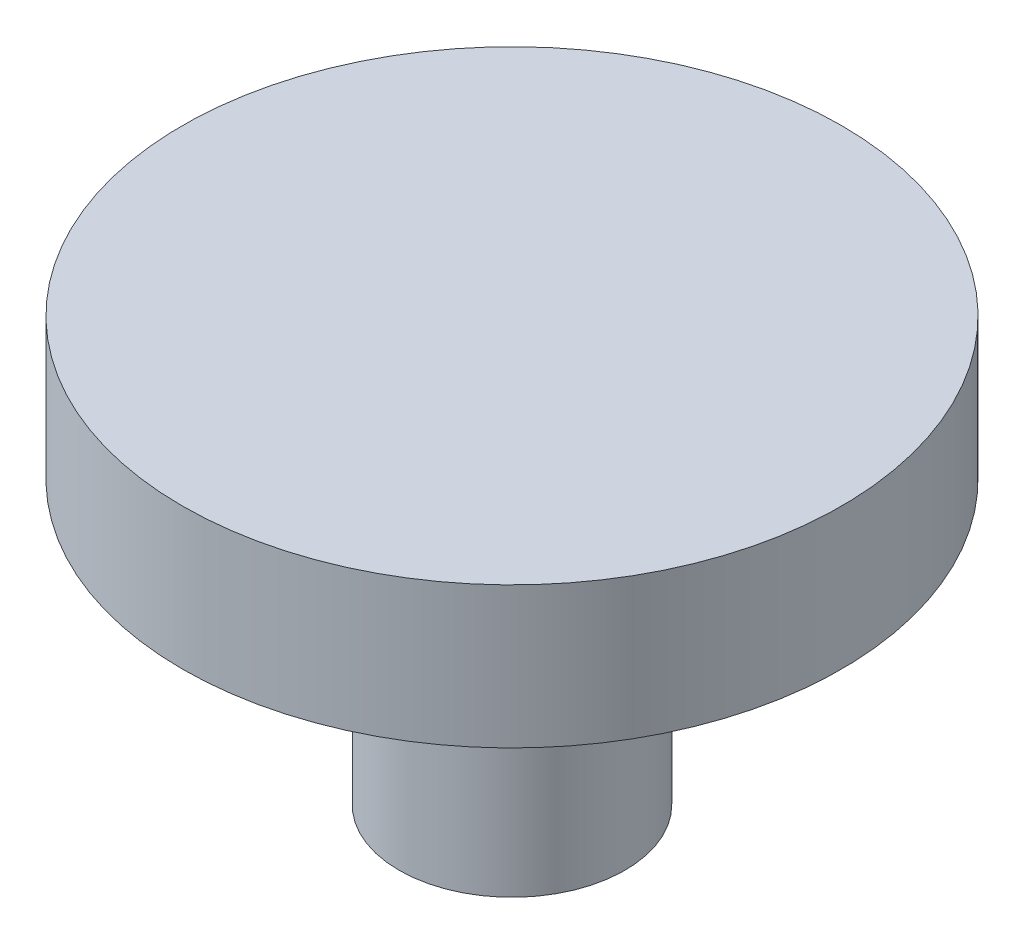
ISO-10303-21;
HEADER;
FILE_DESCRIPTION(('STEP AP214'),'2;1');
FILE_NAME('part.step','',(''),(''),'','','');
FILE_SCHEMA(('AUTOMOTIVE_DESIGN { 1 0 10303 214 1 1 1 1 }'));
ENDSEC;
DATA;
#1=APPLICATION_CONTEXT('core data for automotive mechanical design processes');
#2=APPLICATION_PROTOCOL_DEFINITION('international standard','automotive_design',2000,#1);
#3=PRODUCT_CONTEXT('',#1,'mechanical');
#4=PRODUCT('Part','Part','',(#3));
#5=PRODUCT_RELATED_PRODUCT_CATEGORY('part','',(#4));
#6=PRODUCT_DEFINITION_FORMATION('','',#4);
#7=PRODUCT_DEFINITION_CONTEXT('part definition',#1,'design');
#8=PRODUCT_DEFINITION('design','',#6,#7);
#9=PRODUCT_DEFINITION_SHAPE('','',#8);
#10=(LENGTH_UNIT() NAMED_UNIT(*) SI_UNIT(.MILLI.,.METRE.));
#11=(NAMED_UNIT(*) PLANE_ANGLE_UNIT() SI_UNIT($,.RADIAN.));
#12=(NAMED_UNIT(*) SI_UNIT($,.STERADIAN.) SOLID_ANGLE_UNIT());
#13=UNCERTAINTY_MEASURE_WITH_UNIT(LENGTH_MEASURE(1.E-05),#10,'distance_accuracy_value','');
#14=(GEOMETRIC_REPRESENTATION_CONTEXT(3) GLOBAL_UNCERTAINTY_ASSIGNED_CONTEXT((#13)) GLOBAL_UNIT_ASSIGNED_CONTEXT((#10,
#11,#12)) REPRESENTATION_CONTEXT('',''));
#15=CARTESIAN_POINT('',(0.,0.,0.));
#16=DIRECTION('',(0.,0.,1.));
#17=DIRECTION('',(1.,0.,0.));
#18=AXIS2_PLACEMENT_3D('',#15,#16,#17);
#19=CARTESIAN_POINT('',(0.,3.,0.));
#20=DIRECTION('',(0.,-1.,0.));
#21=DIRECTION('',(0.,0.,-1.));
#22=AXIS2_PLACEMENT_3D('',#19,#20,#21);
#23=CYLINDRICAL_SURFACE('',#22,2.4);
#24=CARTESIAN_POINT('',(0.,3.,0.));
#25=DIRECTION('',(0.,1.,0.));
#26=DIRECTION('',(0.,0.,1.));
#27=AXIS2_PLACEMENT_3D('',#24,#25,#26);
#28=CIRCLE('',#27,2.4);
#29=CARTESIAN_POINT('',(0.,3.,2.4));
#30=VERTEX_POINT('',#29);
#31=EDGE_CURVE('E10',#30,#30,#28,.T.);
#32=ORIENTED_EDGE('',*,*,#31,.F.);
#33=EDGE_LOOP('',(#32));
#34=FACE_BOUND('',#33,.T.);
#35=CARTESIAN_POINT('',(0.,-3.,0.));
#36=DIRECTION('',(0.,1.,0.));
#37=DIRECTION('',(0.,0.,1.));
#38=AXIS2_PLACEMENT_3D('',#35,#36,#37);
#39=CIRCLE('',#38,2.4);
#40=CARTESIAN_POINT('',(0.,-3.,2.4));
#41=VERTEX_POINT('',#40);
#42=EDGE_CURVE('E33',#41,#41,#39,.T.);
#43=ORIENTED_EDGE('',*,*,#42,.T.);
#44=EDGE_LOOP('',(#43));
#45=FACE_BOUND('',#44,.T.);
#46=ADVANCED_FACE('F30',(#34,#45),#23,.T.);
#47=CARTESIAN_POINT('',(0.,-3.,0.));
#48=DIRECTION('',(0.,1.,0.));
#49=DIRECTION('',(0.,0.,1.));
#50=AXIS2_PLACEMENT_3D('',#47,#48,#49);
#51=PLANE('',#50);
#52=ORIENTED_EDGE('',*,*,#42,.F.);
#53=EDGE_LOOP('',(#52));
#54=FACE_BOUND('',#53,.T.);
#55=ADVANCED_FACE('F53',(#54),#51,.F.);
#56=CARTESIAN_POINT('',(0.,6.,0.));
#57=DIRECTION('',(0.,-1.,0.));
#58=DIRECTION('',(0.,0.,-1.));
#59=AXIS2_PLACEMENT_3D('',#56,#57,#58);
#60=CYLINDRICAL_SURFACE('',#59,7.);
#61=CARTESIAN_POINT('',(0.,6.,0.));
#62=DIRECTION('',(0.,1.,0.));
#63=DIRECTION('',(0.,0.,1.));
#64=AXIS2_PLACEMENT_3D('',#61,#62,#63);
#65=CIRCLE('',#64,7.);
#66=CARTESIAN_POINT('',(0.,6.,7.));
#67=VERTEX_POINT('',#66);
#68=EDGE_CURVE('E40',#67,#67,#65,.T.);
#69=ORIENTED_EDGE('',*,*,#68,.F.);
#70=EDGE_LOOP('',(#69));
#71=FACE_BOUND('',#70,.T.);
#72=CARTESIAN_POINT('',(0.,3.,0.));
#73=DIRECTION('',(0.,1.,0.));
#74=DIRECTION('',(0.,0.,1.));
#75=AXIS2_PLACEMENT_3D('',#72,#73,#74);
#76=CIRCLE('',#75,7.);
#77=CARTESIAN_POINT('',(0.,3.,7.));
#78=VERTEX_POINT('',#77);
#79=EDGE_CURVE('E42',#78,#78,#76,.T.);
#80=ORIENTED_EDGE('',*,*,#79,.T.);
#81=EDGE_LOOP('',(#80));
#82=FACE_BOUND('',#81,.T.);
#83=ADVANCED_FACE('F50',(#71,#82),#60,.T.);
#84=CARTESIAN_POINT('',(0.,6.,0.));
#85=DIRECTION('',(0.,1.,0.));
#86=DIRECTION('',(0.,0.,1.));
#87=AXIS2_PLACEMENT_3D('',#84,#85,#86);
#88=PLANE('',#87);
#89=ORIENTED_EDGE('',*,*,#68,.T.);
#90=EDGE_LOOP('',(#89));
#91=FACE_BOUND('',#90,.T.);
#92=ADVANCED_FACE('F48',(#91),#88,.T.);
#93=CARTESIAN_POINT('',(0.,3.,0.));
#94=DIRECTION('',(0.,1.,0.));
#95=DIRECTION('',(0.,0.,1.));
#96=AXIS2_PLACEMENT_3D('',#93,#94,#95);
#97=PLANE('',#96);
#98=ORIENTED_EDGE('',*,*,#31,.T.);
#99=EDGE_LOOP('',(#98));
#100=FACE_BOUND('',#99,.T.);
#101=ORIENTED_EDGE('',*,*,#79,.F.);
#102=EDGE_LOOP('',(#101));
#103=FACE_BOUND('',#102,.T.);
#104=ADVANCED_FACE('F57',(#100,#103),#97,.F.);
#105=CLOSED_SHELL('',(#46,#55,#83,#92,#104));
#106=MANIFOLD_SOLID_BREP('B2',#105);
#107=ADVANCED_BREP_SHAPE_REPRESENTATION('',(#18,#106),#14);
#108=SHAPE_DEFINITION_REPRESENTATION(#9,#107);
ENDSEC;
END-ISO-10303-21;
